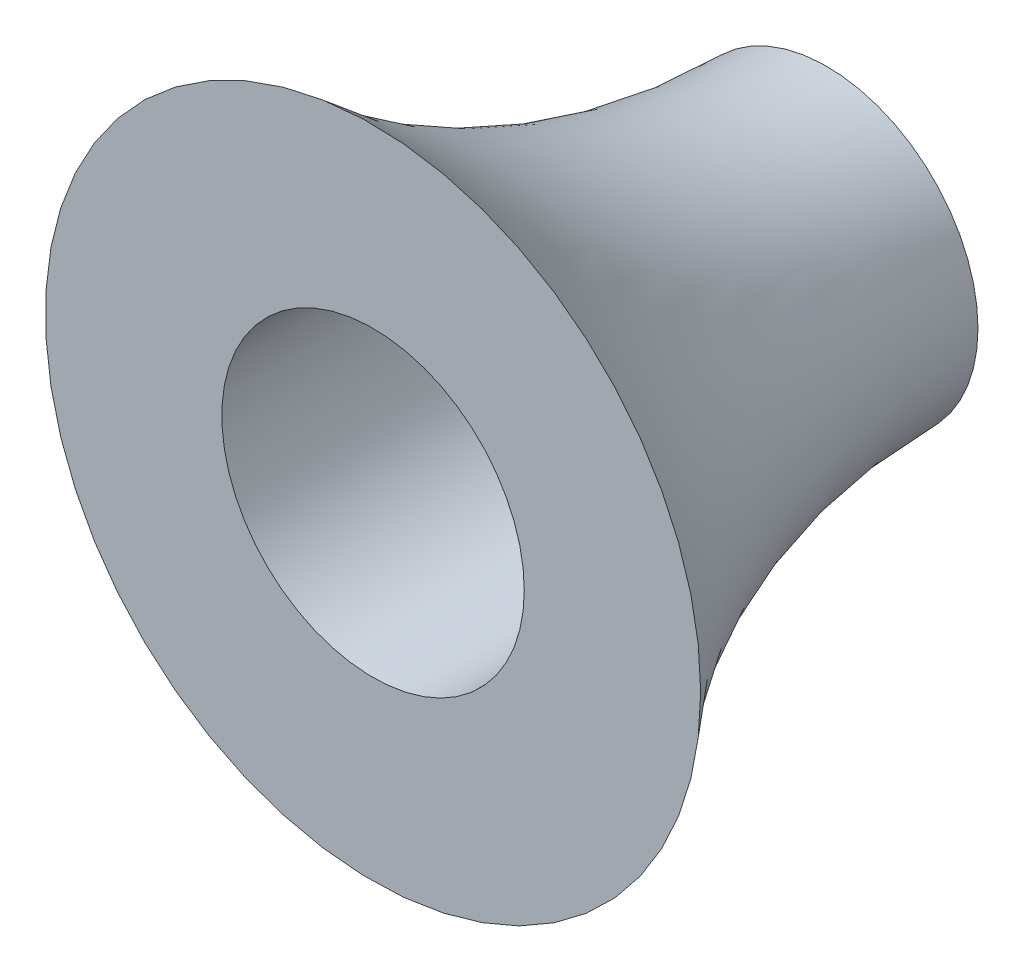
ISO-10303-21;
HEADER;
FILE_DESCRIPTION(('STEP AP214'),'2;1');
FILE_NAME('part.step','',(''),(''),'','','');
FILE_SCHEMA(('AUTOMOTIVE_DESIGN { 1 0 10303 214 1 1 1 1 }'));
ENDSEC;
DATA;
#1=APPLICATION_CONTEXT('core data for automotive mechanical design processes');
#2=APPLICATION_PROTOCOL_DEFINITION('international standard','automotive_design',2000,#1);
#3=PRODUCT_CONTEXT('',#1,'mechanical');
#4=PRODUCT('Part','Part','',(#3));
#5=PRODUCT_RELATED_PRODUCT_CATEGORY('part','',(#4));
#6=PRODUCT_DEFINITION_FORMATION('','',#4);
#7=PRODUCT_DEFINITION_CONTEXT('part definition',#1,'design');
#8=PRODUCT_DEFINITION('design','',#6,#7);
#9=PRODUCT_DEFINITION_SHAPE('','',#8);
#10=(LENGTH_UNIT() NAMED_UNIT(*) SI_UNIT(.MILLI.,.METRE.));
#11=(NAMED_UNIT(*) PLANE_ANGLE_UNIT() SI_UNIT($,.RADIAN.));
#12=(NAMED_UNIT(*) SI_UNIT($,.STERADIAN.) SOLID_ANGLE_UNIT());
#13=UNCERTAINTY_MEASURE_WITH_UNIT(LENGTH_MEASURE(1.E-05),#10,'distance_accuracy_value','');
#14=(GEOMETRIC_REPRESENTATION_CONTEXT(3) GLOBAL_UNCERTAINTY_ASSIGNED_CONTEXT((#13)) GLOBAL_UNIT_ASSIGNED_CONTEXT((#10,
#11,#12)) REPRESENTATION_CONTEXT('',''));
#15=CARTESIAN_POINT('',(0.,0.,0.));
#16=DIRECTION('',(0.,0.,1.));
#17=DIRECTION('',(1.,0.,0.));
#18=AXIS2_PLACEMENT_3D('',#15,#16,#17);
#19=CARTESIAN_POINT('',(-7.00805526532028,3.31694473467972,-7.02));
#20=DIRECTION('',(0.,0.,1.));
#21=DIRECTION('',(1.,0.,0.));
#22=AXIS2_PLACEMENT_3D('',#19,#20,#21);
#23=PLANE('',#22);
#24=CARTESIAN_POINT('',(-6.125,4.2,-7.02));
#25=DIRECTION('',(0.,0.,1.));
#26=DIRECTION('',(1.,0.,0.));
#27=AXIS2_PLACEMENT_3D('',#24,#25,#26);
#28=CIRCLE('',#27,0.299999999999997);
#29=CARTESIAN_POINT('',(-5.825,4.2,-7.02));
#30=VERTEX_POINT('',#29);
#31=EDGE_CURVE('E19',#30,#30,#28,.T.);
#32=ORIENTED_EDGE('',*,*,#31,.F.);
#33=EDGE_LOOP('',(#32));
#34=FACE_BOUND('',#33,.T.);
#35=CARTESIAN_POINT('',(-6.125,4.2,-7.01999999999981));
#36=DIRECTION('',(0.,0.,1.));
#37=DIRECTION('',(1.,0.,0.));
#38=AXIS2_PLACEMENT_3D('',#35,#36,#37);
#39=CIRCLE('',#38,0.650000000001199);
#40=CARTESIAN_POINT('',(-5.4749999999988,4.2,-7.01999999999981));
#41=VERTEX_POINT('',#40);
#42=EDGE_CURVE('E23',#41,#41,#39,.F.);
#43=ORIENTED_EDGE('',*,*,#42,.F.);
#44=EDGE_LOOP('',(#43));
#45=FACE_BOUND('',#44,.T.);
#46=ADVANCED_FACE('F15',(#34,#45),#23,.T.);
#47=CARTESIAN_POINT('',(-6.125,4.2,-7.92));
#48=DIRECTION('',(0.,0.,1.));
#49=DIRECTION('',(1.,0.,0.));
#50=AXIS2_PLACEMENT_3D('',#47,#48,#49);
#51=CYLINDRICAL_SURFACE('',#50,0.299999999999997);
#52=ORIENTED_EDGE('',*,*,#31,.T.);
#53=EDGE_LOOP('',(#52));
#54=FACE_BOUND('',#53,.T.);
#55=CARTESIAN_POINT('',(-6.125,4.2,-7.92));
#56=DIRECTION('',(0.,0.,1.));
#57=DIRECTION('',(1.,0.,0.));
#58=AXIS2_PLACEMENT_3D('',#55,#56,#57);
#59=CIRCLE('',#58,0.299999999999997);
#60=CARTESIAN_POINT('',(-5.825,4.2,-7.92));
#61=VERTEX_POINT('',#60);
#62=EDGE_CURVE('E10',#61,#61,#59,.T.);
#63=ORIENTED_EDGE('',*,*,#62,.F.);
#64=EDGE_LOOP('',(#63));
#65=FACE_BOUND('',#64,.T.);
#66=ADVANCED_FACE('F33',(#54,#65),#51,.F.);
#67=CARTESIAN_POINT('',(-6.125,4.2,-7.92));
#68=DIRECTION('',(0.,0.,1.));
#69=DIRECTION('',(1.,0.,0.));
#70=AXIS2_PLACEMENT_3D('',#67,#68,#69);
#71=TOROIDAL_SURFACE('',#70,1.63214285713998,1.33214285713999);
#72=ORIENTED_EDGE('',*,*,#62,.T.);
#73=EDGE_LOOP('',(#72));
#74=FACE_BOUND('',#73,.T.);
#75=ORIENTED_EDGE('',*,*,#42,.T.);
#76=EDGE_LOOP('',(#75));
#77=FACE_BOUND('',#76,.T.);
#78=ADVANCED_FACE('F17',(#74,#77),#71,.F.);
#79=CLOSED_SHELL('',(#46,#66,#78));
#80=MANIFOLD_SOLID_BREP('B1',#79);
#81=ADVANCED_BREP_SHAPE_REPRESENTATION('',(#18,#80),#14);
#82=SHAPE_DEFINITION_REPRESENTATION(#9,#81);
ENDSEC;
END-ISO-10303-21;
